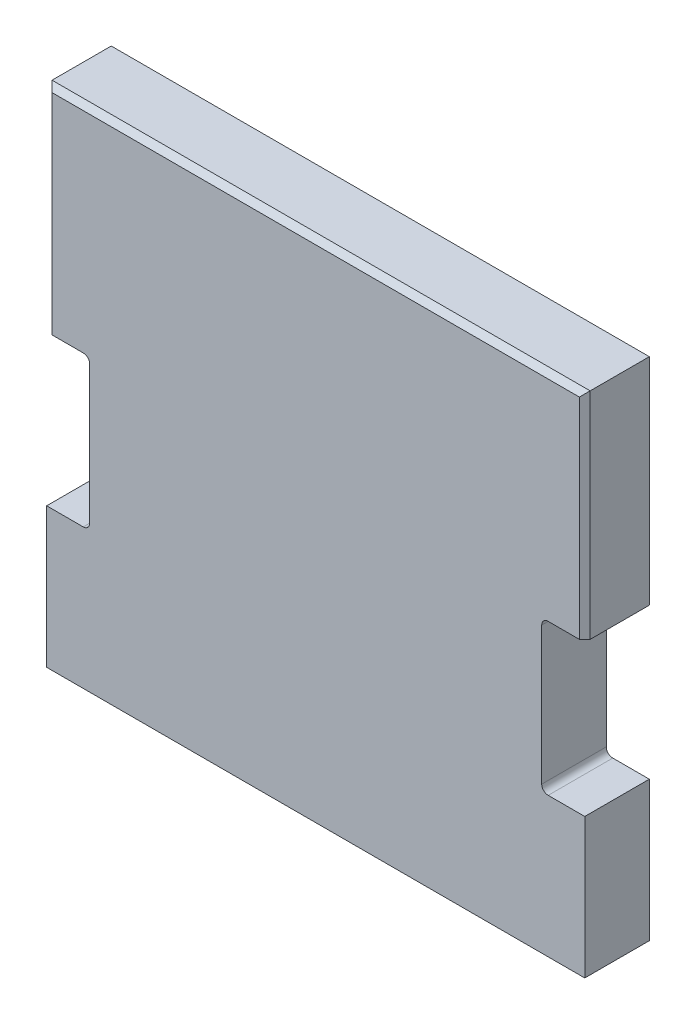
ISO-10303-21;
HEADER;
FILE_DESCRIPTION(('STEP AP214'),'2;1');
FILE_NAME('part.step','',(''),(''),'','','');
FILE_SCHEMA(('AUTOMOTIVE_DESIGN { 1 0 10303 214 1 1 1 1 }'));
ENDSEC;
DATA;
#1=APPLICATION_CONTEXT('core data for automotive mechanical design processes');
#2=APPLICATION_PROTOCOL_DEFINITION('international standard','automotive_design',2000,#1);
#3=PRODUCT_CONTEXT('',#1,'mechanical');
#4=PRODUCT('Part','Part','',(#3));
#5=PRODUCT_RELATED_PRODUCT_CATEGORY('part','',(#4));
#6=PRODUCT_DEFINITION_FORMATION('','',#4);
#7=PRODUCT_DEFINITION_CONTEXT('part definition',#1,'design');
#8=PRODUCT_DEFINITION('design','',#6,#7);
#9=PRODUCT_DEFINITION_SHAPE('','',#8);
#10=(LENGTH_UNIT() NAMED_UNIT(*) SI_UNIT(.MILLI.,.METRE.));
#11=(NAMED_UNIT(*) PLANE_ANGLE_UNIT() SI_UNIT($,.RADIAN.));
#12=(NAMED_UNIT(*) SI_UNIT($,.STERADIAN.) SOLID_ANGLE_UNIT());
#13=UNCERTAINTY_MEASURE_WITH_UNIT(LENGTH_MEASURE(1.E-05),#10,'distance_accuracy_value','');
#14=(GEOMETRIC_REPRESENTATION_CONTEXT(3) GLOBAL_UNCERTAINTY_ASSIGNED_CONTEXT((#13)) GLOBAL_UNIT_ASSIGNED_CONTEXT((#10,
#11,#12)) REPRESENTATION_CONTEXT('',''));
#15=CARTESIAN_POINT('',(0.,0.,0.));
#16=DIRECTION('',(0.,0.,1.));
#17=DIRECTION('',(1.,0.,0.));
#18=AXIS2_PLACEMENT_3D('',#15,#16,#17);
#19=CARTESIAN_POINT('',(25.,0.,3.));
#20=DIRECTION('',(0.,1.,0.));
#21=DIRECTION('',(-1.,0.,0.));
#22=AXIS2_PLACEMENT_3D('',#19,#20,#21);
#23=PLANE('',#22);
#24=DIRECTION('',(1.,0.,0.));
#25=VECTOR('',#24,1.);
#26=CARTESIAN_POINT('',(25.,0.,0.));
#27=LINE('',#26,#25);
#28=CARTESIAN_POINT('',(0.,0.,0.));
#29=VERTEX_POINT('',#28);
#30=CARTESIAN_POINT('',(25.,0.,0.));
#31=VERTEX_POINT('',#30);
#32=EDGE_CURVE('E183',#29,#31,#27,.T.);
#33=ORIENTED_EDGE('',*,*,#32,.T.);
#34=DIRECTION('',(0.,0.,-1.));
#35=VECTOR('',#34,1.);
#36=CARTESIAN_POINT('',(25.,0.,3.));
#37=LINE('',#36,#35);
#38=CARTESIAN_POINT('',(25.,0.,3.));
#39=VERTEX_POINT('',#38);
#40=EDGE_CURVE('E163',#39,#31,#37,.T.);
#41=ORIENTED_EDGE('',*,*,#40,.F.);
#42=DIRECTION('',(1.,0.,0.));
#43=VECTOR('',#42,1.);
#44=CARTESIAN_POINT('',(25.,0.,3.));
#45=LINE('',#44,#43);
#46=CARTESIAN_POINT('',(0.,0.,3.));
#47=VERTEX_POINT('',#46);
#48=EDGE_CURVE('E170',#47,#39,#45,.T.);
#49=ORIENTED_EDGE('',*,*,#48,.F.);
#50=DIRECTION('',(0.,0.,-1.));
#51=VECTOR('',#50,1.);
#52=CARTESIAN_POINT('',(0.,0.,3.));
#53=LINE('',#52,#51);
#54=EDGE_CURVE('E249',#47,#29,#53,.T.);
#55=ORIENTED_EDGE('',*,*,#54,.T.);
#56=EDGE_LOOP('',(#33,#41,#49,#55));
#57=FACE_BOUND('',#56,.T.);
#58=ADVANCED_FACE('F34',(#57),#23,.F.);
#59=CARTESIAN_POINT('',(25.,6.5,3.));
#60=DIRECTION('',(-1.,0.,0.));
#61=DIRECTION('',(0.,0.,1.));
#62=AXIS2_PLACEMENT_3D('',#59,#60,#61);
#63=PLANE('',#62);
#64=DIRECTION('',(0.,1.,0.));
#65=VECTOR('',#64,1.);
#66=CARTESIAN_POINT('',(25.,6.5,0.));
#67=LINE('',#66,#65);
#68=CARTESIAN_POINT('',(25.,6.5,0.));
#69=VERTEX_POINT('',#68);
#70=EDGE_CURVE('E212',#31,#69,#67,.T.);
#71=ORIENTED_EDGE('',*,*,#70,.T.);
#72=DIRECTION('',(0.,0.,-1.));
#73=VECTOR('',#72,1.);
#74=CARTESIAN_POINT('',(25.,6.5,3.));
#75=LINE('',#74,#73);
#76=CARTESIAN_POINT('',(25.,6.5,3.));
#77=VERTEX_POINT('',#76);
#78=EDGE_CURVE('E166',#77,#69,#75,.T.);
#79=ORIENTED_EDGE('',*,*,#78,.F.);
#80=DIRECTION('',(0.,1.,0.));
#81=VECTOR('',#80,1.);
#82=CARTESIAN_POINT('',(25.,6.5,3.));
#83=LINE('',#82,#81);
#84=EDGE_CURVE('E159',#39,#77,#83,.T.);
#85=ORIENTED_EDGE('',*,*,#84,.F.);
#86=ORIENTED_EDGE('',*,*,#40,.T.);
#87=EDGE_LOOP('',(#71,#79,#85,#86));
#88=FACE_BOUND('',#87,.T.);
#89=ADVANCED_FACE('F161',(#88),#63,.F.);
#90=CARTESIAN_POINT('',(23.3,6.5,3.));
#91=DIRECTION('',(0.,-1.,0.));
#92=DIRECTION('',(0.,0.,-1.));
#93=AXIS2_PLACEMENT_3D('',#90,#91,#92);
#94=PLANE('',#93);
#95=DIRECTION('',(-1.,0.,0.));
#96=VECTOR('',#95,1.);
#97=CARTESIAN_POINT('',(23.3,6.5,0.));
#98=LINE('',#97,#96);
#99=CARTESIAN_POINT('',(23.3,6.5,0.));
#100=VERTEX_POINT('',#99);
#101=EDGE_CURVE('E214',#69,#100,#98,.T.);
#102=ORIENTED_EDGE('',*,*,#101,.T.);
#103=DIRECTION('',(0.,0.,-1.));
#104=VECTOR('',#103,1.);
#105=CARTESIAN_POINT('',(23.3,6.5,3.));
#106=LINE('',#105,#104);
#107=CARTESIAN_POINT('',(23.3,6.5,3.));
#108=VERTEX_POINT('',#107);
#109=EDGE_CURVE('E188',#108,#100,#106,.T.);
#110=ORIENTED_EDGE('',*,*,#109,.F.);
#111=DIRECTION('',(-1.,0.,0.));
#112=VECTOR('',#111,1.);
#113=CARTESIAN_POINT('',(23.3,6.5,3.));
#114=LINE('',#113,#112);
#115=EDGE_CURVE('E169',#77,#108,#114,.T.);
#116=ORIENTED_EDGE('',*,*,#115,.F.);
#117=ORIENTED_EDGE('',*,*,#78,.T.);
#118=EDGE_LOOP('',(#102,#110,#116,#117));
#119=FACE_BOUND('',#118,.T.);
#120=ADVANCED_FACE('F332',(#119),#94,.F.);
#121=CARTESIAN_POINT('',(23.3,6.8,3.));
#122=DIRECTION('',(0.,0.,-1.));
#123=DIRECTION('',(-1.,0.,0.));
#124=AXIS2_PLACEMENT_3D('',#121,#122,#123);
#125=CYLINDRICAL_SURFACE('',#124,0.300000000000001);
#126=CARTESIAN_POINT('',(23.3,6.8,0.));
#127=DIRECTION('',(0.,0.,-1.));
#128=DIRECTION('',(-1.,0.,0.));
#129=AXIS2_PLACEMENT_3D('',#126,#127,#128);
#130=CIRCLE('',#129,0.300000000000001);
#131=CARTESIAN_POINT('',(23.,6.80000000000001,0.));
#132=VERTEX_POINT('',#131);
#133=EDGE_CURVE('E220',#100,#132,#130,.T.);
#134=ORIENTED_EDGE('',*,*,#133,.T.);
#135=DIRECTION('',(0.,0.,-1.));
#136=VECTOR('',#135,1.);
#137=CARTESIAN_POINT('',(23.,6.80000000000001,3.));
#138=LINE('',#137,#136);
#139=CARTESIAN_POINT('',(23.,6.80000000000001,3.));
#140=VERTEX_POINT('',#139);
#141=EDGE_CURVE('E280',#140,#132,#138,.T.);
#142=ORIENTED_EDGE('',*,*,#141,.F.);
#143=CARTESIAN_POINT('',(23.3,6.8,3.));
#144=DIRECTION('',(0.,0.,-1.));
#145=DIRECTION('',(-1.,0.,0.));
#146=AXIS2_PLACEMENT_3D('',#143,#144,#145);
#147=CIRCLE('',#146,0.300000000000001);
#148=EDGE_CURVE('E289',#108,#140,#147,.T.);
#149=ORIENTED_EDGE('',*,*,#148,.F.);
#150=ORIENTED_EDGE('',*,*,#109,.T.);
#151=EDGE_LOOP('',(#134,#142,#149,#150));
#152=FACE_BOUND('',#151,.T.);
#153=ADVANCED_FACE('F287',(#152),#125,.F.);
#154=CARTESIAN_POINT('',(23.,13.2,3.));
#155=DIRECTION('',(-1.,0.,0.));
#156=DIRECTION('',(0.,0.,1.));
#157=AXIS2_PLACEMENT_3D('',#154,#155,#156);
#158=PLANE('',#157);
#159=DIRECTION('',(0.,1.,0.));
#160=VECTOR('',#159,1.);
#161=CARTESIAN_POINT('',(23.,13.2,0.));
#162=LINE('',#161,#160);
#163=CARTESIAN_POINT('',(23.,13.2,0.));
#164=VERTEX_POINT('',#163);
#165=EDGE_CURVE('E222',#132,#164,#162,.T.);
#166=ORIENTED_EDGE('',*,*,#165,.T.);
#167=DIRECTION('',(0.,0.,-1.));
#168=VECTOR('',#167,1.);
#169=CARTESIAN_POINT('',(23.,13.2,3.));
#170=LINE('',#169,#168);
#171=CARTESIAN_POINT('',(23.,13.2,3.));
#172=VERTEX_POINT('',#171);
#173=EDGE_CURVE('E277',#172,#164,#170,.T.);
#174=ORIENTED_EDGE('',*,*,#173,.F.);
#175=DIRECTION('',(0.,1.,0.));
#176=VECTOR('',#175,1.);
#177=CARTESIAN_POINT('',(23.,13.2,3.));
#178=LINE('',#177,#176);
#179=EDGE_CURVE('E308',#140,#172,#178,.T.);
#180=ORIENTED_EDGE('',*,*,#179,.F.);
#181=ORIENTED_EDGE('',*,*,#141,.T.);
#182=EDGE_LOOP('',(#166,#174,#180,#181));
#183=FACE_BOUND('',#182,.T.);
#184=ADVANCED_FACE('F299',(#183),#158,.F.);
#185=CARTESIAN_POINT('',(23.3,13.2,3.));
#186=DIRECTION('',(0.,0.,-1.));
#187=DIRECTION('',(-1.,0.,0.));
#188=AXIS2_PLACEMENT_3D('',#185,#186,#187);
#189=CYLINDRICAL_SURFACE('',#188,0.300000000000001);
#190=CARTESIAN_POINT('',(23.3,13.2,0.));
#191=DIRECTION('',(0.,0.,-1.));
#192=DIRECTION('',(-1.,0.,0.));
#193=AXIS2_PLACEMENT_3D('',#190,#191,#192);
#194=CIRCLE('',#193,0.300000000000001);
#195=CARTESIAN_POINT('',(23.3,13.5,0.));
#196=VERTEX_POINT('',#195);
#197=EDGE_CURVE('E224',#164,#196,#194,.T.);
#198=ORIENTED_EDGE('',*,*,#197,.T.);
#199=DIRECTION('',(0.,0.,-1.));
#200=VECTOR('',#199,1.);
#201=CARTESIAN_POINT('',(23.3,13.5,3.));
#202=LINE('',#201,#200);
#203=CARTESIAN_POINT('',(23.3,13.5,3.));
#204=VERTEX_POINT('',#203);
#205=EDGE_CURVE('E274',#204,#196,#202,.T.);
#206=ORIENTED_EDGE('',*,*,#205,.F.);
#207=CARTESIAN_POINT('',(23.3,13.2,3.));
#208=DIRECTION('',(0.,0.,-1.));
#209=DIRECTION('',(-1.,0.,0.));
#210=AXIS2_PLACEMENT_3D('',#207,#208,#209);
#211=CIRCLE('',#210,0.300000000000001);
#212=EDGE_CURVE('E305',#172,#204,#211,.T.);
#213=ORIENTED_EDGE('',*,*,#212,.F.);
#214=ORIENTED_EDGE('',*,*,#173,.T.);
#215=EDGE_LOOP('',(#198,#206,#213,#214));
#216=FACE_BOUND('',#215,.T.);
#217=ADVANCED_FACE('F303',(#216),#189,.F.);
#218=CARTESIAN_POINT('',(25.,13.5,3.));
#219=DIRECTION('',(0.,1.,0.));
#220=DIRECTION('',(0.,0.,1.));
#221=AXIS2_PLACEMENT_3D('',#218,#219,#220);
#222=PLANE('',#221);
#223=DIRECTION('',(0.,0.,-1.));
#224=VECTOR('',#223,1.);
#225=CARTESIAN_POINT('',(25.,13.5,3.));
#226=LINE('',#225,#224);
#227=CARTESIAN_POINT('',(25.,13.5,2.75));
#228=VERTEX_POINT('',#227);
#229=CARTESIAN_POINT('',(25.,13.5,0.));
#230=VERTEX_POINT('',#229);
#231=EDGE_CURVE('E272',#228,#230,#226,.T.);
#232=ORIENTED_EDGE('',*,*,#231,.F.);
#233=DIRECTION('',(-0.707106781186552,0.,0.707106781186543));
#234=VECTOR('',#233,1.);
#235=CARTESIAN_POINT('',(24.75,13.5,3.));
#236=LINE('',#235,#234);
#237=CARTESIAN_POINT('',(24.75,13.5,3.));
#238=VERTEX_POINT('',#237);
#239=EDGE_CURVE('E198',#228,#238,#236,.T.);
#240=ORIENTED_EDGE('',*,*,#239,.T.);
#241=DIRECTION('',(1.,0.,0.));
#242=VECTOR('',#241,1.);
#243=CARTESIAN_POINT('',(25.,13.5,3.));
#244=LINE('',#243,#242);
#245=EDGE_CURVE('E307',#204,#238,#244,.T.);
#246=ORIENTED_EDGE('',*,*,#245,.F.);
#247=ORIENTED_EDGE('',*,*,#205,.T.);
#248=DIRECTION('',(1.,0.,0.));
#249=VECTOR('',#248,1.);
#250=CARTESIAN_POINT('',(25.,13.5,0.));
#251=LINE('',#250,#249);
#252=EDGE_CURVE('E226',#196,#230,#251,.T.);
#253=ORIENTED_EDGE('',*,*,#252,.T.);
#254=EDGE_LOOP('',(#232,#240,#246,#247,#253));
#255=FACE_BOUND('',#254,.T.);
#256=ADVANCED_FACE('F370',(#255),#222,.F.);
#257=CARTESIAN_POINT('',(25.,23.5,3.));
#258=DIRECTION('',(-1.,0.,0.));
#259=DIRECTION('',(0.,0.,1.));
#260=AXIS2_PLACEMENT_3D('',#257,#258,#259);
#261=PLANE('',#260);
#262=DIRECTION('',(0.,0.,-1.));
#263=VECTOR('',#262,1.);
#264=CARTESIAN_POINT('',(25.,23.5,3.));
#265=LINE('',#264,#263);
#266=CARTESIAN_POINT('',(25.,23.5,2.75));
#267=VERTEX_POINT('',#266);
#268=CARTESIAN_POINT('',(25.,23.5,0.));
#269=VERTEX_POINT('',#268);
#270=EDGE_CURVE('E270',#267,#269,#265,.T.);
#271=ORIENTED_EDGE('',*,*,#270,.F.);
#272=DIRECTION('',(0.,-1.,0.));
#273=VECTOR('',#272,1.);
#274=CARTESIAN_POINT('',(25.,13.5,2.75));
#275=LINE('',#274,#273);
#276=EDGE_CURVE('E196',#267,#228,#275,.T.);
#277=ORIENTED_EDGE('',*,*,#276,.T.);
#278=ORIENTED_EDGE('',*,*,#231,.T.);
#279=DIRECTION('',(0.,1.,0.));
#280=VECTOR('',#279,1.);
#281=CARTESIAN_POINT('',(25.,23.5,0.));
#282=LINE('',#281,#280);
#283=EDGE_CURVE('E229',#230,#269,#282,.T.);
#284=ORIENTED_EDGE('',*,*,#283,.T.);
#285=EDGE_LOOP('',(#271,#277,#278,#284));
#286=FACE_BOUND('',#285,.T.);
#287=ADVANCED_FACE('F364',(#286),#261,.F.);
#288=CARTESIAN_POINT('',(0.,23.5,3.));
#289=DIRECTION('',(0.,-1.,0.));
#290=DIRECTION('',(0.,0.,-1.));
#291=AXIS2_PLACEMENT_3D('',#288,#289,#290);
#292=PLANE('',#291);
#293=DIRECTION('',(0.,0.,-1.));
#294=VECTOR('',#293,1.);
#295=CARTESIAN_POINT('',(0.,23.5,3.));
#296=LINE('',#295,#294);
#297=CARTESIAN_POINT('',(0.,23.5,2.75));
#298=VERTEX_POINT('',#297);
#299=CARTESIAN_POINT('',(0.,23.5,0.));
#300=VERTEX_POINT('',#299);
#301=EDGE_CURVE('E268',#298,#300,#296,.T.);
#302=ORIENTED_EDGE('',*,*,#301,.F.);
#303=DIRECTION('',(1.,0.,0.));
#304=VECTOR('',#303,1.);
#305=CARTESIAN_POINT('',(25.,23.5,2.75));
#306=LINE('',#305,#304);
#307=EDGE_CURVE('E200',#298,#267,#306,.T.);
#308=ORIENTED_EDGE('',*,*,#307,.T.);
#309=ORIENTED_EDGE('',*,*,#270,.T.);
#310=DIRECTION('',(-1.,0.,0.));
#311=VECTOR('',#310,1.);
#312=CARTESIAN_POINT('',(0.,23.5,0.));
#313=LINE('',#312,#311);
#314=EDGE_CURVE('E232',#269,#300,#313,.T.);
#315=ORIENTED_EDGE('',*,*,#314,.T.);
#316=EDGE_LOOP('',(#302,#308,#309,#315));
#317=FACE_BOUND('',#316,.T.);
#318=ADVANCED_FACE('F362',(#317),#292,.F.);
#319=CARTESIAN_POINT('',(0.,13.5,3.));
#320=DIRECTION('',(1.,0.,0.));
#321=DIRECTION('',(0.,0.,-1.));
#322=AXIS2_PLACEMENT_3D('',#319,#320,#321);
#323=PLANE('',#322);
#324=DIRECTION('',(0.,0.,-1.));
#325=VECTOR('',#324,1.);
#326=CARTESIAN_POINT('',(0.,13.5,3.));
#327=LINE('',#326,#325);
#328=CARTESIAN_POINT('',(0.,13.5,2.75));
#329=VERTEX_POINT('',#328);
#330=CARTESIAN_POINT('',(0.,13.5,0.));
#331=VERTEX_POINT('',#330);
#332=EDGE_CURVE('E266',#329,#331,#327,.T.);
#333=ORIENTED_EDGE('',*,*,#332,.F.);
#334=DIRECTION('',(0.,1.,0.));
#335=VECTOR('',#334,1.);
#336=CARTESIAN_POINT('',(0.,23.5,2.75));
#337=LINE('',#336,#335);
#338=EDGE_CURVE('E11',#329,#298,#337,.T.);
#339=ORIENTED_EDGE('',*,*,#338,.T.);
#340=ORIENTED_EDGE('',*,*,#301,.T.);
#341=DIRECTION('',(0.,-1.,0.));
#342=VECTOR('',#341,1.);
#343=CARTESIAN_POINT('',(0.,13.5,0.));
#344=LINE('',#343,#342);
#345=EDGE_CURVE('E235',#300,#331,#344,.T.);
#346=ORIENTED_EDGE('',*,*,#345,.T.);
#347=EDGE_LOOP('',(#333,#339,#340,#346));
#348=FACE_BOUND('',#347,.T.);
#349=ADVANCED_FACE('F388',(#348),#323,.F.);
#350=CARTESIAN_POINT('',(1.7,13.5,3.));
#351=DIRECTION('',(0.,1.,0.));
#352=DIRECTION('',(0.,0.,1.));
#353=AXIS2_PLACEMENT_3D('',#350,#351,#352);
#354=PLANE('',#353);
#355=DIRECTION('',(1.,0.,0.));
#356=VECTOR('',#355,1.);
#357=CARTESIAN_POINT('',(1.7,13.5,3.));
#358=LINE('',#357,#356);
#359=CARTESIAN_POINT('',(0.250000000000001,13.5,3.));
#360=VERTEX_POINT('',#359);
#361=CARTESIAN_POINT('',(1.7,13.5,3.));
#362=VERTEX_POINT('',#361);
#363=EDGE_CURVE('E310',#360,#362,#358,.T.);
#364=ORIENTED_EDGE('',*,*,#363,.F.);
#365=DIRECTION('',(-0.707106781186552,0.,-0.707106781186543));
#366=VECTOR('',#365,1.);
#367=CARTESIAN_POINT('',(0.25,13.5,3.));
#368=LINE('',#367,#366);
#369=EDGE_CURVE('E43',#360,#329,#368,.T.);
#370=ORIENTED_EDGE('',*,*,#369,.T.);
#371=ORIENTED_EDGE('',*,*,#332,.T.);
#372=DIRECTION('',(1.,0.,0.));
#373=VECTOR('',#372,1.);
#374=CARTESIAN_POINT('',(1.7,13.5,0.));
#375=LINE('',#374,#373);
#376=CARTESIAN_POINT('',(1.7,13.5,0.));
#377=VERTEX_POINT('',#376);
#378=EDGE_CURVE('E238',#331,#377,#375,.T.);
#379=ORIENTED_EDGE('',*,*,#378,.T.);
#380=DIRECTION('',(0.,0.,-1.));
#381=VECTOR('',#380,1.);
#382=CARTESIAN_POINT('',(1.7,13.5,3.));
#383=LINE('',#382,#381);
#384=EDGE_CURVE('E263',#362,#377,#383,.T.);
#385=ORIENTED_EDGE('',*,*,#384,.F.);
#386=EDGE_LOOP('',(#364,#370,#371,#379,#385));
#387=FACE_BOUND('',#386,.T.);
#388=ADVANCED_FACE('F372',(#387),#354,.F.);
#389=CARTESIAN_POINT('',(1.7,13.2,3.));
#390=DIRECTION('',(0.,0.,-1.));
#391=DIRECTION('',(-1.,0.,0.));
#392=AXIS2_PLACEMENT_3D('',#389,#390,#391);
#393=CYLINDRICAL_SURFACE('',#392,0.3);
#394=CARTESIAN_POINT('',(1.7,13.2,0.));
#395=DIRECTION('',(0.,0.,-1.));
#396=DIRECTION('',(1.,0.,0.));
#397=AXIS2_PLACEMENT_3D('',#394,#395,#396);
#398=CIRCLE('',#397,0.3);
#399=CARTESIAN_POINT('',(2.,13.2,0.));
#400=VERTEX_POINT('',#399);
#401=EDGE_CURVE('E240',#377,#400,#398,.T.);
#402=ORIENTED_EDGE('',*,*,#401,.T.);
#403=DIRECTION('',(0.,0.,-1.));
#404=VECTOR('',#403,1.);
#405=CARTESIAN_POINT('',(2.,13.2,3.));
#406=LINE('',#405,#404);
#407=CARTESIAN_POINT('',(2.,13.2,3.));
#408=VERTEX_POINT('',#407);
#409=EDGE_CURVE('E260',#408,#400,#406,.T.);
#410=ORIENTED_EDGE('',*,*,#409,.F.);
#411=CARTESIAN_POINT('',(1.7,13.2,3.));
#412=DIRECTION('',(0.,0.,-1.));
#413=DIRECTION('',(1.,0.,0.));
#414=AXIS2_PLACEMENT_3D('',#411,#412,#413);
#415=CIRCLE('',#414,0.3);
#416=EDGE_CURVE('E316',#362,#408,#415,.T.);
#417=ORIENTED_EDGE('',*,*,#416,.F.);
#418=ORIENTED_EDGE('',*,*,#384,.T.);
#419=EDGE_LOOP('',(#402,#410,#417,#418));
#420=FACE_BOUND('',#419,.T.);
#421=ADVANCED_FACE('F378',(#420),#393,.F.);
#422=CARTESIAN_POINT('',(2.,6.80000000000001,3.));
#423=DIRECTION('',(1.,0.,0.));
#424=DIRECTION('',(0.,0.,-1.));
#425=AXIS2_PLACEMENT_3D('',#422,#423,#424);
#426=PLANE('',#425);
#427=DIRECTION('',(0.,-1.,0.));
#428=VECTOR('',#427,1.);
#429=CARTESIAN_POINT('',(2.,6.80000000000001,0.));
#430=LINE('',#429,#428);
#431=CARTESIAN_POINT('',(2.,6.80000000000001,0.));
#432=VERTEX_POINT('',#431);
#433=EDGE_CURVE('E242',#400,#432,#430,.T.);
#434=ORIENTED_EDGE('',*,*,#433,.T.);
#435=DIRECTION('',(0.,0.,-1.));
#436=VECTOR('',#435,1.);
#437=CARTESIAN_POINT('',(2.,6.80000000000001,3.));
#438=LINE('',#437,#436);
#439=CARTESIAN_POINT('',(2.,6.80000000000001,3.));
#440=VERTEX_POINT('',#439);
#441=EDGE_CURVE('E257',#440,#432,#438,.T.);
#442=ORIENTED_EDGE('',*,*,#441,.F.);
#443=DIRECTION('',(0.,-1.,0.));
#444=VECTOR('',#443,1.);
#445=CARTESIAN_POINT('',(2.,6.80000000000001,3.));
#446=LINE('',#445,#444);
#447=EDGE_CURVE('E318',#408,#440,#446,.T.);
#448=ORIENTED_EDGE('',*,*,#447,.F.);
#449=ORIENTED_EDGE('',*,*,#409,.T.);
#450=EDGE_LOOP('',(#434,#442,#448,#449));
#451=FACE_BOUND('',#450,.T.);
#452=ADVANCED_FACE('F382',(#451),#426,.F.);
#453=CARTESIAN_POINT('',(1.7,6.8,3.));
#454=DIRECTION('',(0.,0.,-1.));
#455=DIRECTION('',(-1.,0.,0.));
#456=AXIS2_PLACEMENT_3D('',#453,#454,#455);
#457=CYLINDRICAL_SURFACE('',#456,0.3);
#458=CARTESIAN_POINT('',(1.7,6.8,0.));
#459=DIRECTION('',(0.,0.,-1.));
#460=DIRECTION('',(1.,0.,0.));
#461=AXIS2_PLACEMENT_3D('',#458,#459,#460);
#462=CIRCLE('',#461,0.3);
#463=CARTESIAN_POINT('',(1.7,6.5,0.));
#464=VERTEX_POINT('',#463);
#465=EDGE_CURVE('E244',#432,#464,#462,.T.);
#466=ORIENTED_EDGE('',*,*,#465,.T.);
#467=DIRECTION('',(0.,0.,-1.));
#468=VECTOR('',#467,1.);
#469=CARTESIAN_POINT('',(1.7,6.5,3.));
#470=LINE('',#469,#468);
#471=CARTESIAN_POINT('',(1.7,6.5,3.));
#472=VERTEX_POINT('',#471);
#473=EDGE_CURVE('E254',#472,#464,#470,.T.);
#474=ORIENTED_EDGE('',*,*,#473,.F.);
#475=CARTESIAN_POINT('',(1.7,6.8,3.));
#476=DIRECTION('',(0.,0.,-1.));
#477=DIRECTION('',(1.,0.,0.));
#478=AXIS2_PLACEMENT_3D('',#475,#476,#477);
#479=CIRCLE('',#478,0.3);
#480=EDGE_CURVE('E320',#440,#472,#479,.T.);
#481=ORIENTED_EDGE('',*,*,#480,.F.);
#482=ORIENTED_EDGE('',*,*,#441,.T.);
#483=EDGE_LOOP('',(#466,#474,#481,#482));
#484=FACE_BOUND('',#483,.T.);
#485=ADVANCED_FACE('F386',(#484),#457,.F.);
#486=CARTESIAN_POINT('',(0.,6.5,3.));
#487=DIRECTION('',(0.,-1.,0.));
#488=DIRECTION('',(0.,0.,-1.));
#489=AXIS2_PLACEMENT_3D('',#486,#487,#488);
#490=PLANE('',#489);
#491=DIRECTION('',(-1.,0.,0.));
#492=VECTOR('',#491,1.);
#493=CARTESIAN_POINT('',(0.,6.5,0.));
#494=LINE('',#493,#492);
#495=CARTESIAN_POINT('',(0.,6.5,0.));
#496=VERTEX_POINT('',#495);
#497=EDGE_CURVE('E246',#464,#496,#494,.T.);
#498=ORIENTED_EDGE('',*,*,#497,.T.);
#499=DIRECTION('',(0.,0.,-1.));
#500=VECTOR('',#499,1.);
#501=CARTESIAN_POINT('',(0.,6.5,3.));
#502=LINE('',#501,#500);
#503=CARTESIAN_POINT('',(0.,6.5,3.));
#504=VERTEX_POINT('',#503);
#505=EDGE_CURVE('E251',#504,#496,#502,.T.);
#506=ORIENTED_EDGE('',*,*,#505,.F.);
#507=DIRECTION('',(-1.,0.,0.));
#508=VECTOR('',#507,1.);
#509=CARTESIAN_POINT('',(0.,6.5,3.));
#510=LINE('',#509,#508);
#511=EDGE_CURVE('E321',#472,#504,#510,.T.);
#512=ORIENTED_EDGE('',*,*,#511,.F.);
#513=ORIENTED_EDGE('',*,*,#473,.T.);
#514=EDGE_LOOP('',(#498,#506,#512,#513));
#515=FACE_BOUND('',#514,.T.);
#516=ADVANCED_FACE('F327',(#515),#490,.F.);
#517=CARTESIAN_POINT('',(0.,0.,3.));
#518=DIRECTION('',(1.,0.,0.));
#519=DIRECTION('',(0.,0.,-1.));
#520=AXIS2_PLACEMENT_3D('',#517,#518,#519);
#521=PLANE('',#520);
#522=DIRECTION('',(0.,-1.,0.));
#523=VECTOR('',#522,1.);
#524=CARTESIAN_POINT('',(0.,0.,0.));
#525=LINE('',#524,#523);
#526=EDGE_CURVE('E180',#496,#29,#525,.T.);
#527=ORIENTED_EDGE('',*,*,#526,.T.);
#528=ORIENTED_EDGE('',*,*,#54,.F.);
#529=DIRECTION('',(0.,-1.,0.));
#530=VECTOR('',#529,1.);
#531=CARTESIAN_POINT('',(0.,0.,3.));
#532=LINE('',#531,#530);
#533=EDGE_CURVE('E176',#504,#47,#532,.T.);
#534=ORIENTED_EDGE('',*,*,#533,.F.);
#535=ORIENTED_EDGE('',*,*,#505,.T.);
#536=EDGE_LOOP('',(#527,#528,#534,#535));
#537=FACE_BOUND('',#536,.T.);
#538=ADVANCED_FACE('F331',(#537),#521,.F.);
#539=CARTESIAN_POINT('',(1.7,6.8,3.));
#540=DIRECTION('',(0.,0.,1.));
#541=DIRECTION('',(1.,0.,0.));
#542=AXIS2_PLACEMENT_3D('',#539,#540,#541);
#543=PLANE('',#542);
#544=ORIENTED_EDGE('',*,*,#245,.T.);
#545=DIRECTION('',(0.,1.,0.));
#546=VECTOR('',#545,1.);
#547=CARTESIAN_POINT('',(24.75,23.5,3.));
#548=LINE('',#547,#546);
#549=CARTESIAN_POINT('',(24.75,23.25,3.));
#550=VERTEX_POINT('',#549);
#551=EDGE_CURVE('E193',#238,#550,#548,.T.);
#552=ORIENTED_EDGE('',*,*,#551,.T.);
#553=DIRECTION('',(-1.,0.,0.));
#554=VECTOR('',#553,1.);
#555=CARTESIAN_POINT('',(0.,23.25,3.));
#556=LINE('',#555,#554);
#557=CARTESIAN_POINT('',(0.25,23.25,3.));
#558=VERTEX_POINT('',#557);
#559=EDGE_CURVE('E186',#550,#558,#556,.T.);
#560=ORIENTED_EDGE('',*,*,#559,.T.);
#561=DIRECTION('',(0.,-1.,0.));
#562=VECTOR('',#561,1.);
#563=CARTESIAN_POINT('',(0.25,13.5,3.));
#564=LINE('',#563,#562);
#565=EDGE_CURVE('E184',#558,#360,#564,.T.);
#566=ORIENTED_EDGE('',*,*,#565,.T.);
#567=ORIENTED_EDGE('',*,*,#363,.T.);
#568=ORIENTED_EDGE('',*,*,#416,.T.);
#569=ORIENTED_EDGE('',*,*,#447,.T.);
#570=ORIENTED_EDGE('',*,*,#480,.T.);
#571=ORIENTED_EDGE('',*,*,#511,.T.);
#572=ORIENTED_EDGE('',*,*,#533,.T.);
#573=ORIENTED_EDGE('',*,*,#48,.T.);
#574=ORIENTED_EDGE('',*,*,#84,.T.);
#575=ORIENTED_EDGE('',*,*,#115,.T.);
#576=ORIENTED_EDGE('',*,*,#148,.T.);
#577=ORIENTED_EDGE('',*,*,#179,.T.);
#578=ORIENTED_EDGE('',*,*,#212,.T.);
#579=EDGE_LOOP('',(#544,#552,#560,#566,#567,#568,#569,#570,#571,#572,#573,#574,#575,#576,#577,#578));
#580=FACE_BOUND('',#579,.T.);
#581=ADVANCED_FACE('F174',(#580),#543,.T.);
#582=CARTESIAN_POINT('',(1.7,6.8,0.));
#583=DIRECTION('',(0.,0.,1.));
#584=DIRECTION('',(1.,0.,0.));
#585=AXIS2_PLACEMENT_3D('',#582,#583,#584);
#586=PLANE('',#585);
#587=ORIENTED_EDGE('',*,*,#32,.F.);
#588=ORIENTED_EDGE('',*,*,#526,.F.);
#589=ORIENTED_EDGE('',*,*,#497,.F.);
#590=ORIENTED_EDGE('',*,*,#465,.F.);
#591=ORIENTED_EDGE('',*,*,#433,.F.);
#592=ORIENTED_EDGE('',*,*,#401,.F.);
#593=ORIENTED_EDGE('',*,*,#378,.F.);
#594=ORIENTED_EDGE('',*,*,#345,.F.);
#595=ORIENTED_EDGE('',*,*,#314,.F.);
#596=ORIENTED_EDGE('',*,*,#283,.F.);
#597=ORIENTED_EDGE('',*,*,#252,.F.);
#598=ORIENTED_EDGE('',*,*,#197,.F.);
#599=ORIENTED_EDGE('',*,*,#165,.F.);
#600=ORIENTED_EDGE('',*,*,#133,.F.);
#601=ORIENTED_EDGE('',*,*,#101,.F.);
#602=ORIENTED_EDGE('',*,*,#70,.F.);
#603=EDGE_LOOP('',(#587,#588,#589,#590,#591,#592,#593,#594,#595,#596,#597,#598,#599,#600,#601,#602));
#604=FACE_BOUND('',#603,.T.);
#605=ADVANCED_FACE('F294',(#604),#586,.F.);
#606=CARTESIAN_POINT('',(0.25,6.8,3.));
#607=DIRECTION('',(-0.707106781186543,0.,0.707106781186552));
#608=DIRECTION('',(0.707106781186552,0.,0.707106781186543));
#609=AXIS2_PLACEMENT_3D('',#606,#607,#608);
#610=PLANE('',#609);
#611=ORIENTED_EDGE('',*,*,#369,.F.);
#612=ORIENTED_EDGE('',*,*,#565,.F.);
#613=DIRECTION('',(-0.577350269189628,0.577350269189628,-0.57735026918962));
#614=VECTOR('',#613,1.);
#615=CARTESIAN_POINT('',(5.73333333333338,17.7666666666666,8.4833333333333));
#616=LINE('',#615,#614);
#617=EDGE_CURVE('E38',#298,#558,#616,.F.);
#618=ORIENTED_EDGE('',*,*,#617,.F.);
#619=ORIENTED_EDGE('',*,*,#338,.F.);
#620=EDGE_LOOP('',(#611,#612,#618,#619));
#621=FACE_BOUND('',#620,.T.);
#622=ADVANCED_FACE('F36',(#621),#610,.T.);
#623=CARTESIAN_POINT('',(1.7,23.25,3.));
#624=DIRECTION('',(0.,0.707106781186543,0.707106781186552));
#625=DIRECTION('',(0.,-0.707106781186552,0.707106781186543));
#626=AXIS2_PLACEMENT_3D('',#623,#624,#625);
#627=PLANE('',#626);
#628=ORIENTED_EDGE('',*,*,#617,.T.);
#629=ORIENTED_EDGE('',*,*,#559,.F.);
#630=DIRECTION('',(0.577350269189628,0.577350269189628,-0.57735026918962));
#631=VECTOR('',#630,1.);
#632=CARTESIAN_POINT('',(17.0666666666666,15.5666666666666,10.6833333333333));
#633=LINE('',#632,#631);
#634=EDGE_CURVE('E202',#267,#550,#633,.F.);
#635=ORIENTED_EDGE('',*,*,#634,.F.);
#636=ORIENTED_EDGE('',*,*,#307,.F.);
#637=EDGE_LOOP('',(#628,#629,#635,#636));
#638=FACE_BOUND('',#637,.T.);
#639=ADVANCED_FACE('F349',(#638),#627,.T.);
#640=CARTESIAN_POINT('',(24.75,6.8,3.));
#641=DIRECTION('',(0.707106781186543,0.,0.707106781186552));
#642=DIRECTION('',(0.707106781186552,0.,-0.707106781186543));
#643=AXIS2_PLACEMENT_3D('',#640,#641,#642);
#644=PLANE('',#643);
#645=ORIENTED_EDGE('',*,*,#239,.F.);
#646=ORIENTED_EDGE('',*,*,#276,.F.);
#647=ORIENTED_EDGE('',*,*,#634,.T.);
#648=ORIENTED_EDGE('',*,*,#551,.F.);
#649=EDGE_LOOP('',(#645,#646,#647,#648));
#650=FACE_BOUND('',#649,.T.);
#651=ADVANCED_FACE('F347',(#650),#644,.T.);
#652=CLOSED_SHELL('',(#58,#89,#120,#153,#184,#217,#256,#287,#318,#349,#388,#421,#452,#485,#516,
#538,#581,#605,#622,#639,#651));
#653=MANIFOLD_SOLID_BREP('B2',#652);
#654=ADVANCED_BREP_SHAPE_REPRESENTATION('',(#18,#653),#14);
#655=SHAPE_DEFINITION_REPRESENTATION(#9,#654);
ENDSEC;
END-ISO-10303-21;
